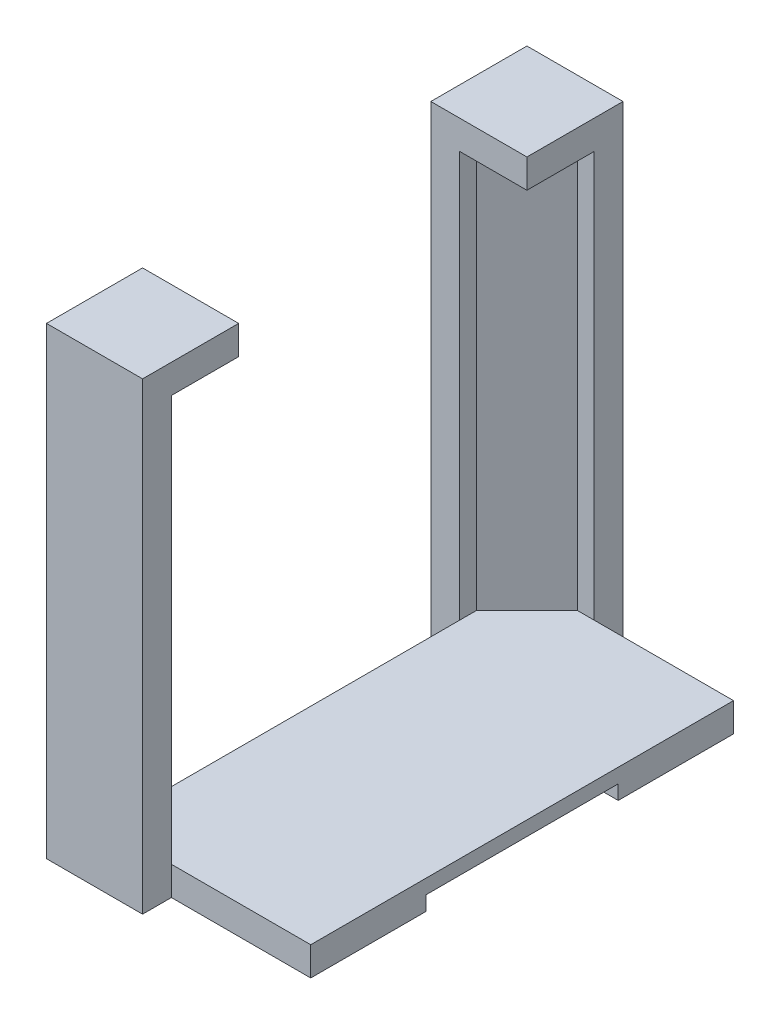
ISO-10303-21;
HEADER;
FILE_DESCRIPTION(('STEP AP214'),'2;1');
FILE_NAME('part.step','',(''),(''),'','','');
FILE_SCHEMA(('AUTOMOTIVE_DESIGN { 1 0 10303 214 1 1 1 1 }'));
ENDSEC;
DATA;
#1=APPLICATION_CONTEXT('core data for automotive mechanical design processes');
#2=APPLICATION_PROTOCOL_DEFINITION('international standard','automotive_design',2000,#1);
#3=PRODUCT_CONTEXT('',#1,'mechanical');
#4=PRODUCT('Part','Part','',(#3));
#5=PRODUCT_RELATED_PRODUCT_CATEGORY('part','',(#4));
#6=PRODUCT_DEFINITION_FORMATION('','',#4);
#7=PRODUCT_DEFINITION_CONTEXT('part definition',#1,'design');
#8=PRODUCT_DEFINITION('design','',#6,#7);
#9=PRODUCT_DEFINITION_SHAPE('','',#8);
#10=(LENGTH_UNIT() NAMED_UNIT(*) SI_UNIT(.MILLI.,.METRE.));
#11=(NAMED_UNIT(*) PLANE_ANGLE_UNIT() SI_UNIT($,.RADIAN.));
#12=(NAMED_UNIT(*) SI_UNIT($,.STERADIAN.) SOLID_ANGLE_UNIT());
#13=UNCERTAINTY_MEASURE_WITH_UNIT(LENGTH_MEASURE(1.E-05),#10,'distance_accuracy_value','');
#14=(GEOMETRIC_REPRESENTATION_CONTEXT(3) GLOBAL_UNCERTAINTY_ASSIGNED_CONTEXT((#13)) GLOBAL_UNIT_ASSIGNED_CONTEXT((#10,
#11,#12)) REPRESENTATION_CONTEXT('',''));
#15=CARTESIAN_POINT('',(0.,0.,0.));
#16=DIRECTION('',(0.,0.,1.));
#17=DIRECTION('',(1.,0.,0.));
#18=AXIS2_PLACEMENT_3D('',#15,#16,#17);
#19=CARTESIAN_POINT('',(0.,3.,0.));
#20=DIRECTION('',(0.,0.,1.));
#21=DIRECTION('',(1.,0.,0.));
#22=AXIS2_PLACEMENT_3D('',#19,#20,#21);
#23=PLANE('',#22);
#24=DIRECTION('',(-1.,0.,0.));
#25=VECTOR('',#24,1.);
#26=CARTESIAN_POINT('',(0.,3.,0.));
#27=LINE('',#26,#25);
#28=CARTESIAN_POINT('',(0.,3.,0.));
#29=VERTEX_POINT('',#28);
#30=CARTESIAN_POINT('',(-14.5,3.,0.));
#31=VERTEX_POINT('',#30);
#32=EDGE_CURVE('E340',#29,#31,#27,.T.);
#33=ORIENTED_EDGE('',*,*,#32,.T.);
#34=DIRECTION('',(0.,-1.,0.));
#35=VECTOR('',#34,1.);
#36=CARTESIAN_POINT('',(-14.5,45.25,0.));
#37=LINE('',#36,#35);
#38=CARTESIAN_POINT('',(-14.5,0.,0.));
#39=VERTEX_POINT('',#38);
#40=EDGE_CURVE('E302',#31,#39,#37,.T.);
#41=ORIENTED_EDGE('',*,*,#40,.T.);
#42=DIRECTION('',(-1.,0.,0.));
#43=VECTOR('',#42,1.);
#44=CARTESIAN_POINT('',(0.,0.,0.));
#45=LINE('',#44,#43);
#46=CARTESIAN_POINT('',(0.,0.,0.));
#47=VERTEX_POINT('',#46);
#48=EDGE_CURVE('E339',#47,#39,#45,.T.);
#49=ORIENTED_EDGE('',*,*,#48,.F.);
#50=DIRECTION('',(0.,-1.,0.));
#51=VECTOR('',#50,1.);
#52=CARTESIAN_POINT('',(0.,3.,0.));
#53=LINE('',#52,#51);
#54=EDGE_CURVE('E369',#29,#47,#53,.T.);
#55=ORIENTED_EDGE('',*,*,#54,.F.);
#56=EDGE_LOOP('',(#33,#41,#49,#55));
#57=FACE_BOUND('',#56,.T.);
#58=ADVANCED_FACE('F41',(#57),#23,.T.);
#59=CARTESIAN_POINT('',(-21.5,3.,0.));
#60=DIRECTION('',(-1.,0.,0.));
#61=DIRECTION('',(0.,0.,1.));
#62=AXIS2_PLACEMENT_3D('',#59,#60,#61);
#63=PLANE('',#62);
#64=DIRECTION('',(0.,-1.,0.));
#65=VECTOR('',#64,1.);
#66=CARTESIAN_POINT('',(-21.5,45.25,-37.));
#67=LINE('',#66,#65);
#68=CARTESIAN_POINT('',(-21.5,3.,-37.));
#69=VERTEX_POINT('',#68);
#70=CARTESIAN_POINT('',(-21.5,0.,-37.));
#71=VERTEX_POINT('',#70);
#72=EDGE_CURVE('E272',#69,#71,#67,.T.);
#73=ORIENTED_EDGE('',*,*,#72,.T.);
#74=DIRECTION('',(0.,0.,-1.));
#75=VECTOR('',#74,1.);
#76=CARTESIAN_POINT('',(-21.5,0.,0.));
#77=LINE('',#76,#75);
#78=CARTESIAN_POINT('',(-21.5,0.,-7.));
#79=VERTEX_POINT('',#78);
#80=EDGE_CURVE('E364',#79,#71,#77,.T.);
#81=ORIENTED_EDGE('',*,*,#80,.F.);
#82=DIRECTION('',(0.,-1.,0.));
#83=VECTOR('',#82,1.);
#84=CARTESIAN_POINT('',(-21.5,45.25,-7.));
#85=LINE('',#84,#83);
#86=CARTESIAN_POINT('',(-21.5,3.,-7.));
#87=VERTEX_POINT('',#86);
#88=EDGE_CURVE('E298',#87,#79,#85,.T.);
#89=ORIENTED_EDGE('',*,*,#88,.F.);
#90=DIRECTION('',(0.,0.,-1.));
#91=VECTOR('',#90,1.);
#92=CARTESIAN_POINT('',(-21.5,3.,0.));
#93=LINE('',#92,#91);
#94=EDGE_CURVE('E354',#87,#69,#93,.T.);
#95=ORIENTED_EDGE('',*,*,#94,.T.);
#96=EDGE_LOOP('',(#73,#81,#89,#95));
#97=FACE_BOUND('',#96,.T.);
#98=ADVANCED_FACE('F420',(#97),#63,.T.);
#99=CARTESIAN_POINT('',(0.,3.,0.));
#100=DIRECTION('',(-1.,0.,0.));
#101=DIRECTION('',(0.,0.,1.));
#102=AXIS2_PLACEMENT_3D('',#99,#100,#101);
#103=PLANE('',#102);
#104=DIRECTION('',(0.,-1.,0.));
#105=VECTOR('',#104,1.);
#106=CARTESIAN_POINT('',(0.,1.5,-32.));
#107=LINE('',#106,#105);
#108=CARTESIAN_POINT('',(0.,1.5,-32.));
#109=VERTEX_POINT('',#108);
#110=CARTESIAN_POINT('',(0.,0.,-32.));
#111=VERTEX_POINT('',#110);
#112=EDGE_CURVE('E336',#109,#111,#107,.T.);
#113=ORIENTED_EDGE('',*,*,#112,.T.);
#114=DIRECTION('',(0.,0.,-1.));
#115=VECTOR('',#114,1.);
#116=CARTESIAN_POINT('',(0.,0.,0.));
#117=LINE('',#116,#115);
#118=CARTESIAN_POINT('',(0.,0.,-44.));
#119=VERTEX_POINT('',#118);
#120=EDGE_CURVE('E357',#111,#119,#117,.T.);
#121=ORIENTED_EDGE('',*,*,#120,.T.);
#122=DIRECTION('',(0.,-1.,0.));
#123=VECTOR('',#122,1.);
#124=CARTESIAN_POINT('',(0.,3.,-44.));
#125=LINE('',#124,#123);
#126=CARTESIAN_POINT('',(0.,3.,-44.));
#127=VERTEX_POINT('',#126);
#128=EDGE_CURVE('E353',#127,#119,#125,.T.);
#129=ORIENTED_EDGE('',*,*,#128,.F.);
#130=DIRECTION('',(0.,0.,-1.));
#131=VECTOR('',#130,1.);
#132=CARTESIAN_POINT('',(0.,3.,0.));
#133=LINE('',#132,#131);
#134=EDGE_CURVE('E343',#29,#127,#133,.T.);
#135=ORIENTED_EDGE('',*,*,#134,.F.);
#136=ORIENTED_EDGE('',*,*,#54,.T.);
#137=CARTESIAN_POINT('',(0.,0.,-12.));
#138=VERTEX_POINT('',#137);
#139=EDGE_CURVE('E358',#47,#138,#117,.T.);
#140=ORIENTED_EDGE('',*,*,#139,.T.);
#141=DIRECTION('',(0.,-1.,0.));
#142=VECTOR('',#141,1.);
#143=CARTESIAN_POINT('',(0.,1.5,-12.));
#144=LINE('',#143,#142);
#145=CARTESIAN_POINT('',(0.,1.5,-12.));
#146=VERTEX_POINT('',#145);
#147=EDGE_CURVE('E323',#146,#138,#144,.T.);
#148=ORIENTED_EDGE('',*,*,#147,.F.);
#149=DIRECTION('',(0.,0.,-1.));
#150=VECTOR('',#149,1.);
#151=CARTESIAN_POINT('',(0.,1.5,0.));
#152=LINE('',#151,#150);
#153=EDGE_CURVE('E313',#146,#109,#152,.T.);
#154=ORIENTED_EDGE('',*,*,#153,.T.);
#155=EDGE_LOOP('',(#113,#121,#129,#135,#136,#140,#148,#154));
#156=FACE_BOUND('',#155,.T.);
#157=ADVANCED_FACE('F444',(#156),#103,.F.);
#158=CARTESIAN_POINT('',(0.,0.,0.));
#159=DIRECTION('',(0.,1.,0.));
#160=DIRECTION('',(0.,0.,1.));
#161=AXIS2_PLACEMENT_3D('',#158,#159,#160);
#162=PLANE('',#161);
#163=DIRECTION('',(-1.,0.,0.));
#164=VECTOR('',#163,1.);
#165=CARTESIAN_POINT('',(0.,0.,-32.));
#166=LINE('',#165,#164);
#167=CARTESIAN_POINT('',(-10.,0.,-32.));
#168=VERTEX_POINT('',#167);
#169=EDGE_CURVE('E312',#111,#168,#166,.T.);
#170=ORIENTED_EDGE('',*,*,#169,.T.);
#171=DIRECTION('',(0.,0.,1.));
#172=VECTOR('',#171,1.);
#173=CARTESIAN_POINT('',(-10.,0.,0.));
#174=LINE('',#173,#172);
#175=CARTESIAN_POINT('',(-10.,0.,-12.));
#176=VERTEX_POINT('',#175);
#177=EDGE_CURVE('E326',#168,#176,#174,.T.);
#178=ORIENTED_EDGE('',*,*,#177,.T.);
#179=DIRECTION('',(1.,0.,0.));
#180=VECTOR('',#179,1.);
#181=CARTESIAN_POINT('',(0.,0.,-12.));
#182=LINE('',#181,#180);
#183=EDGE_CURVE('E317',#176,#138,#182,.T.);
#184=ORIENTED_EDGE('',*,*,#183,.T.);
#185=ORIENTED_EDGE('',*,*,#139,.F.);
#186=ORIENTED_EDGE('',*,*,#48,.T.);
#187=DIRECTION('',(0.,0.,-1.));
#188=VECTOR('',#187,1.);
#189=CARTESIAN_POINT('',(-14.5,0.,0.));
#190=LINE('',#189,#188);
#191=CARTESIAN_POINT('',(-14.5,0.,3.));
#192=VERTEX_POINT('',#191);
#193=EDGE_CURVE('E292',#192,#39,#190,.T.);
#194=ORIENTED_EDGE('',*,*,#193,.F.);
#195=DIRECTION('',(1.,0.,0.));
#196=VECTOR('',#195,1.);
#197=CARTESIAN_POINT('',(0.,0.,3.));
#198=LINE('',#197,#196);
#199=CARTESIAN_POINT('',(-24.5,0.,3.));
#200=VERTEX_POINT('',#199);
#201=EDGE_CURVE('E290',#200,#192,#198,.T.);
#202=ORIENTED_EDGE('',*,*,#201,.F.);
#203=DIRECTION('',(0.,0.,1.));
#204=VECTOR('',#203,1.);
#205=CARTESIAN_POINT('',(-24.5,0.,0.));
#206=LINE('',#205,#204);
#207=CARTESIAN_POINT('',(-24.5,0.,-7.));
#208=VERTEX_POINT('',#207);
#209=EDGE_CURVE('E280',#208,#200,#206,.T.);
#210=ORIENTED_EDGE('',*,*,#209,.F.);
#211=DIRECTION('',(-1.,0.,0.));
#212=VECTOR('',#211,1.);
#213=CARTESIAN_POINT('',(0.,0.,-7.));
#214=LINE('',#213,#212);
#215=EDGE_CURVE('E285',#79,#208,#214,.T.);
#216=ORIENTED_EDGE('',*,*,#215,.F.);
#217=ORIENTED_EDGE('',*,*,#80,.T.);
#218=DIRECTION('',(-1.,0.,0.));
#219=VECTOR('',#218,1.);
#220=CARTESIAN_POINT('',(0.,0.,-37.));
#221=LINE('',#220,#219);
#222=CARTESIAN_POINT('',(-24.5,0.,-37.));
#223=VERTEX_POINT('',#222);
#224=EDGE_CURVE('E257',#71,#223,#221,.T.);
#225=ORIENTED_EDGE('',*,*,#224,.T.);
#226=DIRECTION('',(0.,0.,-1.));
#227=VECTOR('',#226,1.);
#228=CARTESIAN_POINT('',(-24.5,0.,0.));
#229=LINE('',#228,#227);
#230=CARTESIAN_POINT('',(-24.5,0.,-47.));
#231=VERTEX_POINT('',#230);
#232=EDGE_CURVE('E265',#223,#231,#229,.T.);
#233=ORIENTED_EDGE('',*,*,#232,.T.);
#234=DIRECTION('',(1.,0.,0.));
#235=VECTOR('',#234,1.);
#236=CARTESIAN_POINT('',(0.,0.,-47.));
#237=LINE('',#236,#235);
#238=CARTESIAN_POINT('',(-14.5,0.,-47.));
#239=VERTEX_POINT('',#238);
#240=EDGE_CURVE('E262',#231,#239,#237,.T.);
#241=ORIENTED_EDGE('',*,*,#240,.T.);
#242=DIRECTION('',(0.,0.,1.));
#243=VECTOR('',#242,1.);
#244=CARTESIAN_POINT('',(-14.5,0.,0.));
#245=LINE('',#244,#243);
#246=CARTESIAN_POINT('',(-14.5,0.,-44.));
#247=VERTEX_POINT('',#246);
#248=EDGE_CURVE('E254',#239,#247,#245,.T.);
#249=ORIENTED_EDGE('',*,*,#248,.T.);
#250=DIRECTION('',(-1.,0.,0.));
#251=VECTOR('',#250,1.);
#252=CARTESIAN_POINT('',(0.,0.,-44.));
#253=LINE('',#252,#251);
#254=EDGE_CURVE('E361',#119,#247,#253,.T.);
#255=ORIENTED_EDGE('',*,*,#254,.F.);
#256=ORIENTED_EDGE('',*,*,#120,.F.);
#257=EDGE_LOOP('',(#170,#178,#184,#185,#186,#194,#202,#210,#216,#217,#225,#233,#241,#249,#255,#256));
#258=FACE_BOUND('',#257,.T.);
#259=ADVANCED_FACE('F402',(#258),#162,.F.);
#260=CARTESIAN_POINT('',(0.,3.,-44.));
#261=DIRECTION('',(0.,0.,1.));
#262=DIRECTION('',(1.,0.,0.));
#263=AXIS2_PLACEMENT_3D('',#260,#261,#262);
#264=PLANE('',#263);
#265=ORIENTED_EDGE('',*,*,#254,.T.);
#266=DIRECTION('',(0.,-1.,0.));
#267=VECTOR('',#266,1.);
#268=CARTESIAN_POINT('',(-14.5,45.25,-44.));
#269=LINE('',#268,#267);
#270=CARTESIAN_POINT('',(-14.5,3.,-44.));
#271=VERTEX_POINT('',#270);
#272=EDGE_CURVE('E259',#271,#247,#269,.T.);
#273=ORIENTED_EDGE('',*,*,#272,.F.);
#274=DIRECTION('',(-1.,0.,0.));
#275=VECTOR('',#274,1.);
#276=CARTESIAN_POINT('',(0.,3.,-44.));
#277=LINE('',#276,#275);
#278=EDGE_CURVE('E347',#127,#271,#277,.T.);
#279=ORIENTED_EDGE('',*,*,#278,.F.);
#280=ORIENTED_EDGE('',*,*,#128,.T.);
#281=EDGE_LOOP('',(#265,#273,#279,#280));
#282=FACE_BOUND('',#281,.T.);
#283=ADVANCED_FACE('F399',(#282),#264,.F.);
#284=CARTESIAN_POINT('',(0.,3.,0.));
#285=DIRECTION('',(0.,1.,0.));
#286=DIRECTION('',(0.,0.,1.));
#287=AXIS2_PLACEMENT_3D('',#284,#285,#286);
#288=PLANE('',#287);
#289=CARTESIAN_POINT('',(-21.5,3.,-5.25000000000004));
#290=VERTEX_POINT('',#289);
#291=EDGE_CURVE('E351',#290,#87,#93,.T.);
#292=ORIENTED_EDGE('',*,*,#291,.F.);
#293=DIRECTION('',(-0.707106781186544,0.,-0.707106781186551));
#294=VECTOR('',#293,1.);
#295=CARTESIAN_POINT('',(-8.12500000000009,3.,8.12500000000001));
#296=LINE('',#295,#294);
#297=CARTESIAN_POINT('',(-16.25,3.,0.));
#298=VERTEX_POINT('',#297);
#299=EDGE_CURVE('E376',#290,#298,#296,.F.);
#300=ORIENTED_EDGE('',*,*,#299,.T.);
#301=EDGE_CURVE('E344',#31,#298,#27,.T.);
#302=ORIENTED_EDGE('',*,*,#301,.F.);
#303=ORIENTED_EDGE('',*,*,#32,.F.);
#304=ORIENTED_EDGE('',*,*,#134,.T.);
#305=ORIENTED_EDGE('',*,*,#278,.T.);
#306=CARTESIAN_POINT('',(-16.25,3.,-44.));
#307=VERTEX_POINT('',#306);
#308=EDGE_CURVE('E346',#271,#307,#277,.T.);
#309=ORIENTED_EDGE('',*,*,#308,.T.);
#310=DIRECTION('',(-0.707106781186551,0.,0.707106781186544));
#311=VECTOR('',#310,1.);
#312=CARTESIAN_POINT('',(-30.1249999999999,3.,-30.1250000000002));
#313=LINE('',#312,#311);
#314=CARTESIAN_POINT('',(-21.5,3.,-38.75));
#315=VERTEX_POINT('',#314);
#316=EDGE_CURVE('E374',#307,#315,#313,.T.);
#317=ORIENTED_EDGE('',*,*,#316,.T.);
#318=EDGE_CURVE('E350',#69,#315,#93,.T.);
#319=ORIENTED_EDGE('',*,*,#318,.F.);
#320=ORIENTED_EDGE('',*,*,#94,.F.);
#321=EDGE_LOOP('',(#292,#300,#302,#303,#304,#305,#309,#317,#319,#320));
#322=FACE_BOUND('',#321,.T.);
#323=ADVANCED_FACE('F391',(#322),#288,.T.);
#324=CARTESIAN_POINT('',(0.,1.5,-32.));
#325=DIRECTION('',(0.,0.,1.));
#326=DIRECTION('',(1.,0.,0.));
#327=AXIS2_PLACEMENT_3D('',#324,#325,#326);
#328=PLANE('',#327);
#329=ORIENTED_EDGE('',*,*,#169,.F.);
#330=ORIENTED_EDGE('',*,*,#112,.F.);
#331=DIRECTION('',(-1.,0.,0.));
#332=VECTOR('',#331,1.);
#333=CARTESIAN_POINT('',(0.,1.5,-32.));
#334=LINE('',#333,#332);
#335=CARTESIAN_POINT('',(-10.,1.5,-32.));
#336=VERTEX_POINT('',#335);
#337=EDGE_CURVE('E316',#109,#336,#334,.T.);
#338=ORIENTED_EDGE('',*,*,#337,.T.);
#339=DIRECTION('',(0.,-1.,0.));
#340=VECTOR('',#339,1.);
#341=CARTESIAN_POINT('',(-10.,1.5,-32.));
#342=LINE('',#341,#340);
#343=EDGE_CURVE('E334',#336,#168,#342,.T.);
#344=ORIENTED_EDGE('',*,*,#343,.T.);
#345=EDGE_LOOP('',(#329,#330,#338,#344));
#346=FACE_BOUND('',#345,.T.);
#347=ADVANCED_FACE('F461',(#346),#328,.T.);
#348=CARTESIAN_POINT('',(-10.,1.5,0.));
#349=DIRECTION('',(1.,0.,0.));
#350=DIRECTION('',(0.,0.,-1.));
#351=AXIS2_PLACEMENT_3D('',#348,#349,#350);
#352=PLANE('',#351);
#353=ORIENTED_EDGE('',*,*,#177,.F.);
#354=ORIENTED_EDGE('',*,*,#343,.F.);
#355=DIRECTION('',(0.,0.,1.));
#356=VECTOR('',#355,1.);
#357=CARTESIAN_POINT('',(-10.,1.5,0.));
#358=LINE('',#357,#356);
#359=CARTESIAN_POINT('',(-10.,1.5,-12.));
#360=VERTEX_POINT('',#359);
#361=EDGE_CURVE('E319',#336,#360,#358,.T.);
#362=ORIENTED_EDGE('',*,*,#361,.T.);
#363=DIRECTION('',(0.,-1.,0.));
#364=VECTOR('',#363,1.);
#365=CARTESIAN_POINT('',(-10.,1.5,-12.));
#366=LINE('',#365,#364);
#367=EDGE_CURVE('E332',#360,#176,#366,.T.);
#368=ORIENTED_EDGE('',*,*,#367,.T.);
#369=EDGE_LOOP('',(#353,#354,#362,#368));
#370=FACE_BOUND('',#369,.T.);
#371=ADVANCED_FACE('F464',(#370),#352,.T.);
#372=CARTESIAN_POINT('',(0.,1.5,-12.));
#373=DIRECTION('',(0.,0.,-1.));
#374=DIRECTION('',(-1.,0.,0.));
#375=AXIS2_PLACEMENT_3D('',#372,#373,#374);
#376=PLANE('',#375);
#377=ORIENTED_EDGE('',*,*,#183,.F.);
#378=ORIENTED_EDGE('',*,*,#367,.F.);
#379=DIRECTION('',(1.,0.,0.));
#380=VECTOR('',#379,1.);
#381=CARTESIAN_POINT('',(0.,1.5,-12.));
#382=LINE('',#381,#380);
#383=EDGE_CURVE('E321',#360,#146,#382,.T.);
#384=ORIENTED_EDGE('',*,*,#383,.T.);
#385=ORIENTED_EDGE('',*,*,#147,.T.);
#386=EDGE_LOOP('',(#377,#378,#384,#385));
#387=FACE_BOUND('',#386,.T.);
#388=ADVANCED_FACE('F468',(#387),#376,.T.);
#389=CARTESIAN_POINT('',(0.,1.5,0.));
#390=DIRECTION('',(0.,1.,0.));
#391=DIRECTION('',(0.,0.,1.));
#392=AXIS2_PLACEMENT_3D('',#389,#390,#391);
#393=PLANE('',#392);
#394=ORIENTED_EDGE('',*,*,#153,.F.);
#395=ORIENTED_EDGE('',*,*,#383,.F.);
#396=ORIENTED_EDGE('',*,*,#361,.F.);
#397=ORIENTED_EDGE('',*,*,#337,.F.);
#398=EDGE_LOOP('',(#394,#395,#396,#397));
#399=FACE_BOUND('',#398,.T.);
#400=ADVANCED_FACE('F472',(#399),#393,.F.);
#401=CARTESIAN_POINT('',(-24.5,45.25,0.));
#402=DIRECTION('',(1.,0.,0.));
#403=DIRECTION('',(0.,0.,-1.));
#404=AXIS2_PLACEMENT_3D('',#401,#402,#403);
#405=PLANE('',#404);
#406=ORIENTED_EDGE('',*,*,#209,.T.);
#407=DIRECTION('',(0.,-1.,0.));
#408=VECTOR('',#407,1.);
#409=CARTESIAN_POINT('',(-24.5,45.25,3.));
#410=LINE('',#409,#408);
#411=CARTESIAN_POINT('',(-24.5,48.25,3.));
#412=VERTEX_POINT('',#411);
#413=EDGE_CURVE('E309',#412,#200,#410,.T.);
#414=ORIENTED_EDGE('',*,*,#413,.F.);
#415=DIRECTION('',(0.,0.,1.));
#416=VECTOR('',#415,1.);
#417=CARTESIAN_POINT('',(-24.5,48.25,3.));
#418=LINE('',#417,#416);
#419=CARTESIAN_POINT('',(-24.5,48.25,-7.));
#420=VERTEX_POINT('',#419);
#421=EDGE_CURVE('E236',#420,#412,#418,.T.);
#422=ORIENTED_EDGE('',*,*,#421,.F.);
#423=DIRECTION('',(0.,-1.,0.));
#424=VECTOR('',#423,1.);
#425=CARTESIAN_POINT('',(-24.5,45.25,-7.));
#426=LINE('',#425,#424);
#427=EDGE_CURVE('E287',#420,#208,#426,.T.);
#428=ORIENTED_EDGE('',*,*,#427,.T.);
#429=EDGE_LOOP('',(#406,#414,#422,#428));
#430=FACE_BOUND('',#429,.T.);
#431=ADVANCED_FACE('F476',(#430),#405,.F.);
#432=CARTESIAN_POINT('',(0.,45.25,3.));
#433=DIRECTION('',(0.,0.,-1.));
#434=DIRECTION('',(-1.,0.,0.));
#435=AXIS2_PLACEMENT_3D('',#432,#433,#434);
#436=PLANE('',#435);
#437=ORIENTED_EDGE('',*,*,#201,.T.);
#438=DIRECTION('',(0.,-1.,0.));
#439=VECTOR('',#438,1.);
#440=CARTESIAN_POINT('',(-14.5,45.25,3.));
#441=LINE('',#440,#439);
#442=CARTESIAN_POINT('',(-14.5,48.25,3.));
#443=VERTEX_POINT('',#442);
#444=EDGE_CURVE('E306',#443,#192,#441,.T.);
#445=ORIENTED_EDGE('',*,*,#444,.F.);
#446=DIRECTION('',(1.,0.,0.));
#447=VECTOR('',#446,1.);
#448=CARTESIAN_POINT('',(-24.5,48.25,3.));
#449=LINE('',#448,#447);
#450=EDGE_CURVE('E239',#412,#443,#449,.T.);
#451=ORIENTED_EDGE('',*,*,#450,.F.);
#452=ORIENTED_EDGE('',*,*,#413,.T.);
#453=EDGE_LOOP('',(#437,#445,#451,#452));
#454=FACE_BOUND('',#453,.T.);
#455=ADVANCED_FACE('F480',(#454),#436,.F.);
#456=CARTESIAN_POINT('',(-14.5,45.25,0.));
#457=DIRECTION('',(-1.,0.,0.));
#458=DIRECTION('',(0.,0.,1.));
#459=AXIS2_PLACEMENT_3D('',#456,#457,#458);
#460=PLANE('',#459);
#461=ORIENTED_EDGE('',*,*,#193,.T.);
#462=ORIENTED_EDGE('',*,*,#40,.F.);
#463=CARTESIAN_POINT('',(-14.5,45.25,0.));
#464=VERTEX_POINT('',#463);
#465=EDGE_CURVE('E303',#464,#31,#37,.T.);
#466=ORIENTED_EDGE('',*,*,#465,.F.);
#467=DIRECTION('',(0.,0.,-1.));
#468=VECTOR('',#467,1.);
#469=CARTESIAN_POINT('',(-14.5,45.25,3.));
#470=LINE('',#469,#468);
#471=CARTESIAN_POINT('',(-14.5,45.25,-7.));
#472=VERTEX_POINT('',#471);
#473=EDGE_CURVE('E211',#464,#472,#470,.T.);
#474=ORIENTED_EDGE('',*,*,#473,.T.);
#475=DIRECTION('',(0.,-1.,0.));
#476=VECTOR('',#475,1.);
#477=CARTESIAN_POINT('',(-14.5,48.25,-7.));
#478=LINE('',#477,#476);
#479=CARTESIAN_POINT('',(-14.5,48.25,-7.));
#480=VERTEX_POINT('',#479);
#481=EDGE_CURVE('E248',#480,#472,#478,.T.);
#482=ORIENTED_EDGE('',*,*,#481,.F.);
#483=DIRECTION('',(0.,0.,-1.));
#484=VECTOR('',#483,1.);
#485=CARTESIAN_POINT('',(-14.5,48.25,3.));
#486=LINE('',#485,#484);
#487=EDGE_CURVE('E243',#443,#480,#486,.T.);
#488=ORIENTED_EDGE('',*,*,#487,.F.);
#489=ORIENTED_EDGE('',*,*,#444,.T.);
#490=EDGE_LOOP('',(#461,#462,#466,#474,#482,#488,#489));
#491=FACE_BOUND('',#490,.T.);
#492=ADVANCED_FACE('F484',(#491),#460,.F.);
#493=CARTESIAN_POINT('',(0.,45.25,0.));
#494=DIRECTION('',(0.,0.,1.));
#495=DIRECTION('',(1.,0.,0.));
#496=AXIS2_PLACEMENT_3D('',#493,#494,#495);
#497=PLANE('',#496);
#498=ORIENTED_EDGE('',*,*,#301,.T.);
#499=DIRECTION('',(0.,1.,0.));
#500=VECTOR('',#499,1.);
#501=CARTESIAN_POINT('',(-16.25,45.25,0.));
#502=LINE('',#501,#500);
#503=CARTESIAN_POINT('',(-16.25,45.25,0.));
#504=VERTEX_POINT('',#503);
#505=EDGE_CURVE('E378',#298,#504,#502,.T.);
#506=ORIENTED_EDGE('',*,*,#505,.T.);
#507=DIRECTION('',(-1.,0.,0.));
#508=VECTOR('',#507,1.);
#509=CARTESIAN_POINT('',(0.,45.25,0.));
#510=LINE('',#509,#508);
#511=EDGE_CURVE('E281',#464,#504,#510,.T.);
#512=ORIENTED_EDGE('',*,*,#511,.F.);
#513=ORIENTED_EDGE('',*,*,#465,.T.);
#514=EDGE_LOOP('',(#498,#506,#512,#513));
#515=FACE_BOUND('',#514,.T.);
#516=ADVANCED_FACE('F488',(#515),#497,.F.);
#517=CARTESIAN_POINT('',(-21.5,45.25,0.));
#518=DIRECTION('',(-1.,0.,0.));
#519=DIRECTION('',(0.,0.,1.));
#520=AXIS2_PLACEMENT_3D('',#517,#518,#519);
#521=PLANE('',#520);
#522=DIRECTION('',(0.,0.,-1.));
#523=VECTOR('',#522,1.);
#524=CARTESIAN_POINT('',(-21.5,45.25,0.));
#525=LINE('',#524,#523);
#526=CARTESIAN_POINT('',(-21.5,45.25,-5.25000000000004));
#527=VERTEX_POINT('',#526);
#528=CARTESIAN_POINT('',(-21.5,45.25,-7.));
#529=VERTEX_POINT('',#528);
#530=EDGE_CURVE('E284',#527,#529,#525,.T.);
#531=ORIENTED_EDGE('',*,*,#530,.F.);
#532=DIRECTION('',(0.,-1.,0.));
#533=VECTOR('',#532,1.);
#534=CARTESIAN_POINT('',(-21.5,3.,-5.25000000000004));
#535=LINE('',#534,#533);
#536=EDGE_CURVE('E371',#527,#290,#535,.T.);
#537=ORIENTED_EDGE('',*,*,#536,.T.);
#538=ORIENTED_EDGE('',*,*,#291,.T.);
#539=EDGE_CURVE('E299',#529,#87,#85,.T.);
#540=ORIENTED_EDGE('',*,*,#539,.F.);
#541=EDGE_LOOP('',(#531,#537,#538,#540));
#542=FACE_BOUND('',#541,.T.);
#543=ADVANCED_FACE('F428',(#542),#521,.F.);
#544=CARTESIAN_POINT('',(0.,45.25,-7.));
#545=DIRECTION('',(0.,0.,1.));
#546=DIRECTION('',(1.,0.,0.));
#547=AXIS2_PLACEMENT_3D('',#544,#545,#546);
#548=PLANE('',#547);
#549=ORIENTED_EDGE('',*,*,#215,.T.);
#550=ORIENTED_EDGE('',*,*,#427,.F.);
#551=DIRECTION('',(-1.,0.,0.));
#552=VECTOR('',#551,1.);
#553=CARTESIAN_POINT('',(-24.5,48.25,-7.));
#554=LINE('',#553,#552);
#555=EDGE_CURVE('E245',#480,#420,#554,.T.);
#556=ORIENTED_EDGE('',*,*,#555,.F.);
#557=ORIENTED_EDGE('',*,*,#481,.T.);
#558=DIRECTION('',(-1.,0.,0.));
#559=VECTOR('',#558,1.);
#560=CARTESIAN_POINT('',(-24.5,45.25,-7.));
#561=LINE('',#560,#559);
#562=EDGE_CURVE('E240',#472,#529,#561,.T.);
#563=ORIENTED_EDGE('',*,*,#562,.T.);
#564=ORIENTED_EDGE('',*,*,#539,.T.);
#565=ORIENTED_EDGE('',*,*,#88,.T.);
#566=EDGE_LOOP('',(#549,#550,#556,#557,#563,#564,#565));
#567=FACE_BOUND('',#566,.T.);
#568=ADVANCED_FACE('F423',(#567),#548,.F.);
#569=CARTESIAN_POINT('',(-14.5,45.25,0.));
#570=DIRECTION('',(1.,0.,0.));
#571=DIRECTION('',(0.,0.,-1.));
#572=AXIS2_PLACEMENT_3D('',#569,#570,#571);
#573=PLANE('',#572);
#574=ORIENTED_EDGE('',*,*,#248,.F.);
#575=DIRECTION('',(0.,-1.,0.));
#576=VECTOR('',#575,1.);
#577=CARTESIAN_POINT('',(-14.5,45.25,-47.));
#578=LINE('',#577,#576);
#579=CARTESIAN_POINT('',(-14.5,48.25,-47.));
#580=VERTEX_POINT('',#579);
#581=EDGE_CURVE('E278',#580,#239,#578,.T.);
#582=ORIENTED_EDGE('',*,*,#581,.F.);
#583=DIRECTION('',(0.,0.,-1.));
#584=VECTOR('',#583,1.);
#585=CARTESIAN_POINT('',(-14.5,48.25,-47.));
#586=LINE('',#585,#584);
#587=CARTESIAN_POINT('',(-14.5,48.25,-37.));
#588=VERTEX_POINT('',#587);
#589=EDGE_CURVE('E221',#588,#580,#586,.T.);
#590=ORIENTED_EDGE('',*,*,#589,.F.);
#591=DIRECTION('',(0.,-1.,0.));
#592=VECTOR('',#591,1.);
#593=CARTESIAN_POINT('',(-14.5,48.25,-37.));
#594=LINE('',#593,#592);
#595=CARTESIAN_POINT('',(-14.5,45.25,-37.));
#596=VERTEX_POINT('',#595);
#597=EDGE_CURVE('E206',#588,#596,#594,.T.);
#598=ORIENTED_EDGE('',*,*,#597,.T.);
#599=DIRECTION('',(0.,0.,-1.));
#600=VECTOR('',#599,1.);
#601=CARTESIAN_POINT('',(-14.5,45.25,-47.));
#602=LINE('',#601,#600);
#603=CARTESIAN_POINT('',(-14.5,45.25,-44.));
#604=VERTEX_POINT('',#603);
#605=EDGE_CURVE('E212',#596,#604,#602,.T.);
#606=ORIENTED_EDGE('',*,*,#605,.T.);
#607=EDGE_CURVE('E270',#604,#271,#269,.T.);
#608=ORIENTED_EDGE('',*,*,#607,.T.);
#609=ORIENTED_EDGE('',*,*,#272,.T.);
#610=EDGE_LOOP('',(#574,#582,#590,#598,#606,#608,#609));
#611=FACE_BOUND('',#610,.T.);
#612=ADVANCED_FACE('F217',(#611),#573,.T.);
#613=CARTESIAN_POINT('',(0.,45.25,-47.));
#614=DIRECTION('',(0.,0.,-1.));
#615=DIRECTION('',(-1.,0.,0.));
#616=AXIS2_PLACEMENT_3D('',#613,#614,#615);
#617=PLANE('',#616);
#618=ORIENTED_EDGE('',*,*,#240,.F.);
#619=DIRECTION('',(0.,-1.,0.));
#620=VECTOR('',#619,1.);
#621=CARTESIAN_POINT('',(-24.5,45.25,-47.));
#622=LINE('',#621,#620);
#623=CARTESIAN_POINT('',(-24.5,48.25,-47.));
#624=VERTEX_POINT('',#623);
#625=EDGE_CURVE('E276',#624,#231,#622,.T.);
#626=ORIENTED_EDGE('',*,*,#625,.F.);
#627=DIRECTION('',(-1.,0.,0.));
#628=VECTOR('',#627,1.);
#629=CARTESIAN_POINT('',(-24.5,48.25,-47.));
#630=LINE('',#629,#628);
#631=EDGE_CURVE('E225',#580,#624,#630,.T.);
#632=ORIENTED_EDGE('',*,*,#631,.F.);
#633=ORIENTED_EDGE('',*,*,#581,.T.);
#634=EDGE_LOOP('',(#618,#626,#632,#633));
#635=FACE_BOUND('',#634,.T.);
#636=ADVANCED_FACE('F407',(#635),#617,.T.);
#637=CARTESIAN_POINT('',(-24.5,45.25,0.));
#638=DIRECTION('',(-1.,0.,0.));
#639=DIRECTION('',(0.,0.,1.));
#640=AXIS2_PLACEMENT_3D('',#637,#638,#639);
#641=PLANE('',#640);
#642=ORIENTED_EDGE('',*,*,#232,.F.);
#643=DIRECTION('',(0.,-1.,0.));
#644=VECTOR('',#643,1.);
#645=CARTESIAN_POINT('',(-24.5,45.25,-37.));
#646=LINE('',#645,#644);
#647=CARTESIAN_POINT('',(-24.5,48.25,-37.));
#648=VERTEX_POINT('',#647);
#649=EDGE_CURVE('E274',#648,#223,#646,.T.);
#650=ORIENTED_EDGE('',*,*,#649,.F.);
#651=DIRECTION('',(0.,0.,1.));
#652=VECTOR('',#651,1.);
#653=CARTESIAN_POINT('',(-24.5,48.25,-47.));
#654=LINE('',#653,#652);
#655=EDGE_CURVE('E228',#624,#648,#654,.T.);
#656=ORIENTED_EDGE('',*,*,#655,.F.);
#657=ORIENTED_EDGE('',*,*,#625,.T.);
#658=EDGE_LOOP('',(#642,#650,#656,#657));
#659=FACE_BOUND('',#658,.T.);
#660=ADVANCED_FACE('F414',(#659),#641,.T.);
#661=CARTESIAN_POINT('',(0.,45.25,-37.));
#662=DIRECTION('',(0.,0.,1.));
#663=DIRECTION('',(1.,0.,0.));
#664=AXIS2_PLACEMENT_3D('',#661,#662,#663);
#665=PLANE('',#664);
#666=ORIENTED_EDGE('',*,*,#224,.F.);
#667=ORIENTED_EDGE('',*,*,#72,.F.);
#668=CARTESIAN_POINT('',(-21.5,45.25,-37.));
#669=VERTEX_POINT('',#668);
#670=EDGE_CURVE('E209',#669,#69,#67,.T.);
#671=ORIENTED_EDGE('',*,*,#670,.F.);
#672=DIRECTION('',(1.,0.,0.));
#673=VECTOR('',#672,1.);
#674=CARTESIAN_POINT('',(-24.5,45.25,-37.));
#675=LINE('',#674,#673);
#676=EDGE_CURVE('E202',#669,#596,#675,.T.);
#677=ORIENTED_EDGE('',*,*,#676,.T.);
#678=ORIENTED_EDGE('',*,*,#597,.F.);
#679=DIRECTION('',(1.,0.,0.));
#680=VECTOR('',#679,1.);
#681=CARTESIAN_POINT('',(-24.5,48.25,-37.));
#682=LINE('',#681,#680);
#683=EDGE_CURVE('E232',#648,#588,#682,.T.);
#684=ORIENTED_EDGE('',*,*,#683,.F.);
#685=ORIENTED_EDGE('',*,*,#649,.T.);
#686=EDGE_LOOP('',(#666,#667,#671,#677,#678,#684,#685));
#687=FACE_BOUND('',#686,.T.);
#688=ADVANCED_FACE('F204',(#687),#665,.T.);
#689=CARTESIAN_POINT('',(-21.5,45.25,0.));
#690=DIRECTION('',(-1.,0.,0.));
#691=DIRECTION('',(0.,0.,1.));
#692=AXIS2_PLACEMENT_3D('',#689,#690,#691);
#693=PLANE('',#692);
#694=ORIENTED_EDGE('',*,*,#318,.T.);
#695=DIRECTION('',(0.,1.,0.));
#696=VECTOR('',#695,1.);
#697=CARTESIAN_POINT('',(-21.5,45.25,-38.75));
#698=LINE('',#697,#696);
#699=CARTESIAN_POINT('',(-21.5,45.25,-38.75));
#700=VERTEX_POINT('',#699);
#701=EDGE_CURVE('E50',#315,#700,#698,.T.);
#702=ORIENTED_EDGE('',*,*,#701,.T.);
#703=DIRECTION('',(0.,0.,-1.));
#704=VECTOR('',#703,1.);
#705=CARTESIAN_POINT('',(-21.5,45.25,0.));
#706=LINE('',#705,#704);
#707=EDGE_CURVE('E255',#669,#700,#706,.T.);
#708=ORIENTED_EDGE('',*,*,#707,.F.);
#709=ORIENTED_EDGE('',*,*,#670,.T.);
#710=EDGE_LOOP('',(#694,#702,#708,#709));
#711=FACE_BOUND('',#710,.T.);
#712=ADVANCED_FACE('F431',(#711),#693,.F.);
#713=CARTESIAN_POINT('',(0.,45.25,-44.));
#714=DIRECTION('',(0.,0.,1.));
#715=DIRECTION('',(1.,0.,0.));
#716=AXIS2_PLACEMENT_3D('',#713,#714,#715);
#717=PLANE('',#716);
#718=DIRECTION('',(-1.,0.,0.));
#719=VECTOR('',#718,1.);
#720=CARTESIAN_POINT('',(0.,45.25,-44.));
#721=LINE('',#720,#719);
#722=CARTESIAN_POINT('',(-16.25,45.25,-44.));
#723=VERTEX_POINT('',#722);
#724=EDGE_CURVE('E224',#604,#723,#721,.T.);
#725=ORIENTED_EDGE('',*,*,#724,.T.);
#726=DIRECTION('',(0.,-1.,0.));
#727=VECTOR('',#726,1.);
#728=CARTESIAN_POINT('',(-16.25,45.25,-44.));
#729=LINE('',#728,#727);
#730=EDGE_CURVE('E382',#723,#307,#729,.T.);
#731=ORIENTED_EDGE('',*,*,#730,.T.);
#732=ORIENTED_EDGE('',*,*,#308,.F.);
#733=ORIENTED_EDGE('',*,*,#607,.F.);
#734=EDGE_LOOP('',(#725,#731,#732,#733));
#735=FACE_BOUND('',#734,.T.);
#736=ADVANCED_FACE('F387',(#735),#717,.T.);
#737=CARTESIAN_POINT('',(0.,48.25,0.));
#738=DIRECTION('',(0.,-1.,0.));
#739=DIRECTION('',(0.,0.,-1.));
#740=AXIS2_PLACEMENT_3D('',#737,#738,#739);
#741=PLANE('',#740);
#742=ORIENTED_EDGE('',*,*,#421,.T.);
#743=ORIENTED_EDGE('',*,*,#450,.T.);
#744=ORIENTED_EDGE('',*,*,#487,.T.);
#745=ORIENTED_EDGE('',*,*,#555,.T.);
#746=EDGE_LOOP('',(#742,#743,#744,#745));
#747=FACE_BOUND('',#746,.T.);
#748=ADVANCED_FACE('F509',(#747),#741,.F.);
#749=CARTESIAN_POINT('',(0.,45.25,0.));
#750=DIRECTION('',(0.,-1.,0.));
#751=DIRECTION('',(0.,0.,-1.));
#752=AXIS2_PLACEMENT_3D('',#749,#750,#751);
#753=PLANE('',#752);
#754=ORIENTED_EDGE('',*,*,#511,.T.);
#755=DIRECTION('',(0.707106781186544,0.,0.707106781186551));
#756=VECTOR('',#755,1.);
#757=CARTESIAN_POINT('',(-8.12500000000009,45.25,8.12500000000001));
#758=LINE('',#757,#756);
#759=EDGE_CURVE('E380',#504,#527,#758,.F.);
#760=ORIENTED_EDGE('',*,*,#759,.T.);
#761=ORIENTED_EDGE('',*,*,#530,.T.);
#762=ORIENTED_EDGE('',*,*,#562,.F.);
#763=ORIENTED_EDGE('',*,*,#473,.F.);
#764=EDGE_LOOP('',(#754,#760,#761,#762,#763));
#765=FACE_BOUND('',#764,.T.);
#766=ADVANCED_FACE('F510',(#765),#753,.T.);
#767=CARTESIAN_POINT('',(0.,48.25,0.));
#768=DIRECTION('',(0.,-1.,0.));
#769=DIRECTION('',(0.,0.,-1.));
#770=AXIS2_PLACEMENT_3D('',#767,#768,#769);
#771=PLANE('',#770);
#772=ORIENTED_EDGE('',*,*,#631,.T.);
#773=ORIENTED_EDGE('',*,*,#655,.T.);
#774=ORIENTED_EDGE('',*,*,#683,.T.);
#775=ORIENTED_EDGE('',*,*,#589,.T.);
#776=EDGE_LOOP('',(#772,#773,#774,#775));
#777=FACE_BOUND('',#776,.T.);
#778=ADVANCED_FACE('F411',(#777),#771,.F.);
#779=CARTESIAN_POINT('',(0.,45.25,0.));
#780=DIRECTION('',(0.,-1.,0.));
#781=DIRECTION('',(0.,0.,-1.));
#782=AXIS2_PLACEMENT_3D('',#779,#780,#781);
#783=PLANE('',#782);
#784=ORIENTED_EDGE('',*,*,#707,.T.);
#785=DIRECTION('',(0.707106781186551,0.,-0.707106781186544));
#786=VECTOR('',#785,1.);
#787=CARTESIAN_POINT('',(-30.1249999999999,45.25,-30.1250000000002));
#788=LINE('',#787,#786);
#789=EDGE_CURVE('E11',#700,#723,#788,.T.);
#790=ORIENTED_EDGE('',*,*,#789,.T.);
#791=ORIENTED_EDGE('',*,*,#724,.F.);
#792=ORIENTED_EDGE('',*,*,#605,.F.);
#793=ORIENTED_EDGE('',*,*,#676,.F.);
#794=EDGE_LOOP('',(#784,#790,#791,#792,#793));
#795=FACE_BOUND('',#794,.T.);
#796=ADVANCED_FACE('F223',(#795),#783,.T.);
#797=CARTESIAN_POINT('',(-21.5,45.25,-5.25000000000004));
#798=DIRECTION('',(0.707106781186551,0.,-0.707106781186544));
#799=DIRECTION('',(0.,1.,0.));
#800=AXIS2_PLACEMENT_3D('',#797,#798,#799);
#801=PLANE('',#800);
#802=ORIENTED_EDGE('',*,*,#759,.F.);
#803=ORIENTED_EDGE('',*,*,#505,.F.);
#804=ORIENTED_EDGE('',*,*,#299,.F.);
#805=ORIENTED_EDGE('',*,*,#536,.F.);
#806=EDGE_LOOP('',(#802,#803,#804,#805));
#807=FACE_BOUND('',#806,.T.);
#808=ADVANCED_FACE('F433',(#807),#801,.T.);
#809=CARTESIAN_POINT('',(-16.25,45.25,-44.));
#810=DIRECTION('',(-0.707106781186544,0.,-0.707106781186551));
#811=DIRECTION('',(0.,-1.,0.));
#812=AXIS2_PLACEMENT_3D('',#809,#810,#811);
#813=PLANE('',#812);
#814=ORIENTED_EDGE('',*,*,#789,.F.);
#815=ORIENTED_EDGE('',*,*,#701,.F.);
#816=ORIENTED_EDGE('',*,*,#316,.F.);
#817=ORIENTED_EDGE('',*,*,#730,.F.);
#818=EDGE_LOOP('',(#814,#815,#816,#817));
#819=FACE_BOUND('',#818,.T.);
#820=ADVANCED_FACE('F44',(#819),#813,.F.);
#821=CLOSED_SHELL('',(#58,#98,#157,#259,#283,#323,#347,#371,#388,#400,#431,#455,#492,#516,#543,
#568,#612,#636,#660,#688,#712,#736,#748,#766,#778,#796,#808,#820));
#822=MANIFOLD_SOLID_BREP('B2',#821);
#823=ADVANCED_BREP_SHAPE_REPRESENTATION('',(#18,#822),#14);
#824=SHAPE_DEFINITION_REPRESENTATION(#9,#823);
ENDSEC;
END-ISO-10303-21;
